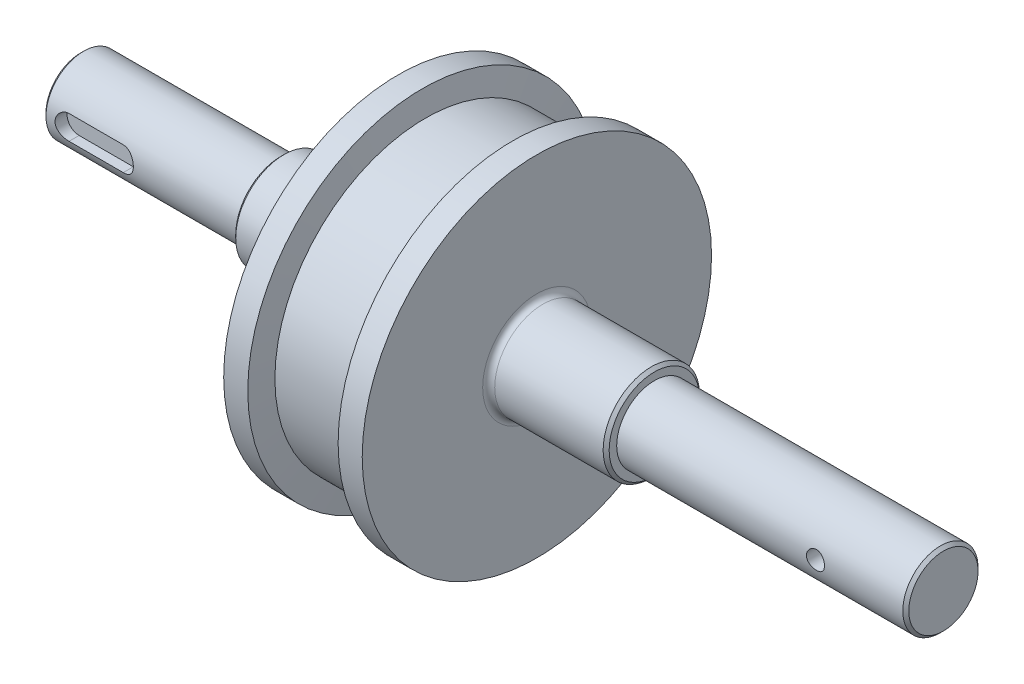
ISO-10303-21;
HEADER;
FILE_DESCRIPTION(('STEP AP214'),'2;1');
FILE_NAME('part.step','',(''),(''),'','','');
FILE_SCHEMA(('AUTOMOTIVE_DESIGN { 1 0 10303 214 1 1 1 1 }'));
ENDSEC;
DATA;
#1=APPLICATION_CONTEXT('core data for automotive mechanical design processes');
#2=APPLICATION_PROTOCOL_DEFINITION('international standard','automotive_design',2000,#1);
#3=PRODUCT_CONTEXT('',#1,'mechanical');
#4=PRODUCT('Part','Part','',(#3));
#5=PRODUCT_RELATED_PRODUCT_CATEGORY('part','',(#4));
#6=PRODUCT_DEFINITION_FORMATION('','',#4);
#7=PRODUCT_DEFINITION_CONTEXT('part definition',#1,'design');
#8=PRODUCT_DEFINITION('design','',#6,#7);
#9=PRODUCT_DEFINITION_SHAPE('','',#8);
#10=(LENGTH_UNIT() NAMED_UNIT(*) SI_UNIT(.MILLI.,.METRE.));
#11=(NAMED_UNIT(*) PLANE_ANGLE_UNIT() SI_UNIT($,.RADIAN.));
#12=(NAMED_UNIT(*) SI_UNIT($,.STERADIAN.) SOLID_ANGLE_UNIT());
#13=UNCERTAINTY_MEASURE_WITH_UNIT(LENGTH_MEASURE(1.E-05),#10,'distance_accuracy_value','');
#14=(GEOMETRIC_REPRESENTATION_CONTEXT(3) GLOBAL_UNCERTAINTY_ASSIGNED_CONTEXT((#13)) GLOBAL_UNIT_ASSIGNED_CONTEXT((#10,
#11,#12)) REPRESENTATION_CONTEXT('',''));
#15=CARTESIAN_POINT('',(0.,0.,0.));
#16=DIRECTION('',(0.,0.,1.));
#17=DIRECTION('',(1.,0.,0.));
#18=AXIS2_PLACEMENT_3D('',#15,#16,#17);
#19=CARTESIAN_POINT('',(286.5,0.,0.));
#20=DIRECTION('',(-1.,0.,0.));
#21=DIRECTION('',(0.,0.,1.));
#22=AXIS2_PLACEMENT_3D('',#19,#20,#21);
#23=PLANE('',#22);
#24=CARTESIAN_POINT('',(286.5,0.,0.));
#25=DIRECTION('',(-1.,0.,0.));
#26=DIRECTION('',(0.,0.,1.));
#27=AXIS2_PLACEMENT_3D('',#24,#25,#26);
#28=CIRCLE('',#27,11.5);
#29=CARTESIAN_POINT('',(286.5,0.,11.5));
#30=VERTEX_POINT('',#29);
#31=EDGE_CURVE('E161',#30,#30,#28,.T.);
#32=ORIENTED_EDGE('',*,*,#31,.F.);
#33=EDGE_LOOP('',(#32));
#34=FACE_BOUND('',#33,.T.);
#35=ADVANCED_FACE('F34',(#34),#23,.F.);
#36=CARTESIAN_POINT('',(286.5,0.,0.));
#37=DIRECTION('',(-1.,0.,0.));
#38=DIRECTION('',(0.,0.,1.));
#39=AXIS2_PLACEMENT_3D('',#36,#37,#38);
#40=CONICAL_SURFACE('',#39,11.5,0.785398163397448);
#41=CARTESIAN_POINT('',(285.5,0.,0.));
#42=DIRECTION('',(-1.,0.,0.));
#43=DIRECTION('',(0.,0.,1.));
#44=AXIS2_PLACEMENT_3D('',#41,#42,#43);
#45=CIRCLE('',#44,12.5);
#46=CARTESIAN_POINT('',(285.5,0.,12.5));
#47=VERTEX_POINT('',#46);
#48=EDGE_CURVE('E158',#47,#47,#45,.T.);
#49=ORIENTED_EDGE('',*,*,#48,.F.);
#50=EDGE_LOOP('',(#49));
#51=FACE_BOUND('',#50,.T.);
#52=ORIENTED_EDGE('',*,*,#31,.T.);
#53=EDGE_LOOP('',(#52));
#54=FACE_BOUND('',#53,.T.);
#55=ADVANCED_FACE('F227',(#51,#54),#40,.T.);
#56=CARTESIAN_POINT('',(0.,0.,0.));
#57=DIRECTION('',(-1.,0.,0.));
#58=DIRECTION('',(0.,0.,1.));
#59=AXIS2_PLACEMENT_3D('',#56,#57,#58);
#60=CYLINDRICAL_SURFACE('',#59,12.5);
#61=CARTESIAN_POINT('',(259.5,0.,12.5));
#62=CARTESIAN_POINT('',(259.499994975923,-0.165963929028717,12.4999970714968));
#63=CARTESIAN_POINT('',(259.486181589764,-0.33198542092807,12.4966615634859));
#64=CARTESIAN_POINT('',(259.431367260405,-0.659284290971382,12.4836783946933));
#65=CARTESIAN_POINT('',(259.390349572005,-0.820558683214273,12.4740268462166));
#66=CARTESIAN_POINT('',(259.282507665496,-1.13358839471401,12.4494823208195));
#67=CARTESIAN_POINT('',(259.215713110142,-1.28535442324821,12.4345953702841));
#68=CARTESIAN_POINT('',(259.058314563554,-1.57552517879761,12.4011725442513));
#69=CARTESIAN_POINT('',(258.967710231923,-1.71392971475165,12.3826366165873));
#70=CARTESIAN_POINT('',(258.763435821624,-1.97609263393971,12.3435386014785));
#71=CARTESIAN_POINT('',(258.649397218951,-2.09955952100478,12.3229472454311));
#72=CARTESIAN_POINT('',(258.402281130935,-2.3258108081194,12.2822574370147));
#73=CARTESIAN_POINT('',(258.269201657959,-2.42859304624486,12.2621590363612));
#74=CARTESIAN_POINT('',(257.985554166982,-2.61189993555013,12.224437969062));
#75=CARTESIAN_POINT('',(257.834773416241,-2.69210377047564,12.2068525815312));
#76=CARTESIAN_POINT('',(257.521380164871,-2.82591582947333,12.1765733412448));
#77=CARTESIAN_POINT('',(257.358769397977,-2.87952794169564,12.1638787734309));
#78=CARTESIAN_POINT('',(257.029523426731,-2.95765058108663,12.1451184675007));
#79=CARTESIAN_POINT('',(256.863018878474,-2.98268262400616,12.1389341034343));
#80=CARTESIAN_POINT('',(256.528067620357,-3.00455808879086,12.1335389605945));
#81=CARTESIAN_POINT('',(256.359621204043,-3.00140571682399,12.1343271412568));
#82=CARTESIAN_POINT('',(256.029524033987,-2.96741912081941,12.1426811387008));
#83=CARTESIAN_POINT('',(255.86780543481,-2.93720103400493,12.1500960921292));
#84=CARTESIAN_POINT('',(255.551802683352,-2.85092141637188,12.1706283738785));
#85=CARTESIAN_POINT('',(255.397519024266,-2.79485817372026,12.1837460799133));
#86=CARTESIAN_POINT('',(255.099087021916,-2.6579412123178,12.2143476734445));
#87=CARTESIAN_POINT('',(254.955047547083,-2.57685948246955,12.2318714325758));
#88=CARTESIAN_POINT('',(254.682395499277,-2.39236688956377,12.2692875046197));
#89=CARTESIAN_POINT('',(254.553785434715,-2.28895240342643,12.2891802016137));
#90=CARTESIAN_POINT('',(254.312106429681,-2.05951493908845,12.329732025739));
#91=CARTESIAN_POINT('',(254.199532900938,-1.93297064389907,12.3503975788014));
#92=CARTESIAN_POINT('',(253.997115280254,-1.66255592459692,12.3896951594929));
#93=CARTESIAN_POINT('',(253.907271779707,-1.51868504982142,12.4083271342049));
#94=CARTESIAN_POINT('',(253.752702779387,-1.21702847718583,12.4415394956922));
#95=CARTESIAN_POINT('',(253.688052543762,-1.05920278696055,12.4561077058019));
#96=CARTESIAN_POINT('',(253.586334920951,-0.734497606078682,12.4794620474154));
#97=CARTESIAN_POINT('',(253.549262682373,-0.567619713387675,12.4882491958651));
#98=CARTESIAN_POINT('',(253.504497935348,-0.233787399651684,12.4989027542709));
#99=CARTESIAN_POINT('',(253.496130107538,-0.0669284805450252,12.5009282130753));
#100=CARTESIAN_POINT('',(253.507166766851,0.265804381586615,12.4982807419474));
#101=CARTESIAN_POINT('',(253.526568961987,0.43167840476494,12.4936083648176));
#102=CARTESIAN_POINT('',(253.592036978516,0.755422580108832,12.4781916395217));
#103=CARTESIAN_POINT('',(253.637739109574,0.913370579311284,12.4675301590363));
#104=CARTESIAN_POINT('',(253.754098191695,1.21935330013475,12.4413335015664));
#105=CARTESIAN_POINT('',(253.824757542978,1.3673870666415,12.4257978558334));
#106=CARTESIAN_POINT('',(253.990366593598,1.65206150995569,12.3911910149582));
#107=CARTESIAN_POINT('',(254.085700716924,1.78847176740352,12.3720653178033));
#108=CARTESIAN_POINT('',(254.297456929013,2.04359904096629,12.3324936406987));
#109=CARTESIAN_POINT('',(254.413882356081,2.16231325074335,12.3120474520734));
#110=CARTESIAN_POINT('',(254.667640831208,2.38142453789941,12.2715742142771));
#111=CARTESIAN_POINT('',(254.805385122082,2.48134974047368,12.2515669262669));
#112=CARTESIAN_POINT('',(255.096090427897,2.65666020824079,12.2147538797452));
#113=CARTESIAN_POINT('',(255.249050761093,2.73204657223349,12.1979479778962));
#114=CARTESIAN_POINT('',(255.565012513544,2.8555899351817,12.1696189519335));
#115=CARTESIAN_POINT('',(255.727948203421,2.90390754385903,12.1580647463107));
#116=CARTESIAN_POINT('',(256.059946185021,2.97238380283977,12.1415072663683));
#117=CARTESIAN_POINT('',(256.229007253762,2.9925480427499,12.1365026916888));
#118=CARTESIAN_POINT('',(256.563670700281,3.00387066449353,12.1337046220624));
#119=CARTESIAN_POINT('',(256.729246496327,2.99578106592265,12.1357241633848));
#120=CARTESIAN_POINT('',(257.056599764224,2.95253345626267,12.1463176460425));
#121=CARTESIAN_POINT('',(257.218377301111,2.91737590900097,12.1548914750658));
#122=CARTESIAN_POINT('',(257.532797552548,2.82138591303537,12.1775274976748));
#123=CARTESIAN_POINT('',(257.685482272584,2.76068402045612,12.191561756094));
#124=CARTESIAN_POINT('',(257.978604413884,2.61543373580582,12.2235433612686));
#125=CARTESIAN_POINT('',(258.119040268586,2.53088229934854,12.2414912075257));
#126=CARTESIAN_POINT('',(258.387337000119,2.33793007708462,12.2798193255291));
#127=CARTESIAN_POINT('',(258.514812323099,2.22900267979017,12.3002478697533));
#128=CARTESIAN_POINT('',(258.749919988052,1.99143074773235,12.3409359831145));
#129=CARTESIAN_POINT('',(258.85754766321,1.86278158874234,12.361195511444));
#130=CARTESIAN_POINT('',(259.051609259555,1.5868829988014,12.3996570299581));
#131=CARTESIAN_POINT('',(259.137668405442,1.43936414359402,12.4178200201219));
#132=CARTESIAN_POINT('',(259.283629532748,1.13153622828568,12.4496380610582));
#133=CARTESIAN_POINT('',(259.343551343392,0.971236973691231,12.4632965272855));
#134=CARTESIAN_POINT('',(259.426038625138,0.675887025694777,12.4824059901497));
#135=CARTESIAN_POINT('',(259.453716615786,0.542312066268429,12.4889599449579));
#136=CARTESIAN_POINT('',(259.490698780852,0.272504227478251,12.4977580149525));
#137=CARTESIAN_POINT('',(259.500004125225,0.136271517915779,12.5000024045682));
#138=CARTESIAN_POINT('',(259.5,0.,12.5));
#139=B_SPLINE_CURVE_WITH_KNOTS('',3,(#61,#62,#63,#64,#65,#66,#67,#68,#69,#70,#71,#72,#73,#74,
#75,#76,#77,#78,#79,#80,#81,#82,#83,#84,#85,#86,#87,#88,#89,#90,#91,#92,#93,#94,#95,#96,#97,#98,
#99,#100,#101,#102,#103,#104,#105,#106,#107,#108,#109,#110,#111,#112,#113,#114,#115,#116,#117,
#118,#119,#120,#121,#122,#123,#124,#125,#126,#127,#128,#129,#130,#131,#132,#133,#134,#135,#136,
#137,#138),.UNSPECIFIED.,.T.,.F.,(4,2,2,2,2,2,2,2,2,2,2,2,2,2,2,2,2,2,2,2,2,2,2,2,2,2,2,2,2,2,2,
2,2,2,2,2,2,2,4),(0.,0.497392599366681,0.995091645758821,1.492219664085,1.98935478998519,
2.49500570148353,3.00070943533304,3.51327262050847,4.02576083835035,4.52873995359107,
5.03164400680462,5.5233827496484,6.01515406709141,6.51154667521178,7.00801987450008,
7.51749958381934,8.02699254752168,8.53799614678202,9.04890983140412,9.54771776810823,
10.0464845383097,10.5385143736981,11.0305915421211,11.5308523313794,12.031192370573,
12.5427824523192,13.0543496229377,13.5628484119092,14.0712462285018,14.5662165454701,
15.0611783809799,15.5536406351283,16.0461657803878,16.5505844610431,17.0551215958269,
17.5678974206351,18.0802835459068,18.4887142303991,18.897118905514),.UNSPECIFIED.);
#140=CARTESIAN_POINT('',(259.5,0.,12.5));
#141=VERTEX_POINT('',#140);
#142=EDGE_CURVE('E107',#141,#141,#139,.T.);
#143=ORIENTED_EDGE('',*,*,#142,.T.);
#144=EDGE_LOOP('',(#143));
#145=FACE_BOUND('',#144,.T.);
#146=CARTESIAN_POINT('',(259.5,0.,-12.5));
#147=CARTESIAN_POINT('',(259.499994975923,0.165963929028717,-12.4999970714968));
#148=CARTESIAN_POINT('',(259.486181589764,0.33198542092807,-12.4966615634859));
#149=CARTESIAN_POINT('',(259.431367260405,0.659284290971382,-12.4836783946933));
#150=CARTESIAN_POINT('',(259.390349572005,0.820558683214273,-12.4740268462166));
#151=CARTESIAN_POINT('',(259.282507665496,1.13358839471401,-12.4494823208195));
#152=CARTESIAN_POINT('',(259.215713110142,1.28535442324821,-12.4345953702841));
#153=CARTESIAN_POINT('',(259.058314563554,1.57552517879761,-12.4011725442513));
#154=CARTESIAN_POINT('',(258.967710231923,1.71392971475165,-12.3826366165873));
#155=CARTESIAN_POINT('',(258.763435821624,1.97609263393971,-12.3435386014785));
#156=CARTESIAN_POINT('',(258.649397218951,2.09955952100478,-12.3229472454311));
#157=CARTESIAN_POINT('',(258.402281130935,2.3258108081194,-12.2822574370147));
#158=CARTESIAN_POINT('',(258.269201657959,2.42859304624486,-12.2621590363612));
#159=CARTESIAN_POINT('',(257.985554166982,2.61189993555013,-12.224437969062));
#160=CARTESIAN_POINT('',(257.834773416241,2.69210377047564,-12.2068525815312));
#161=CARTESIAN_POINT('',(257.521380164871,2.82591582947333,-12.1765733412448));
#162=CARTESIAN_POINT('',(257.358769397977,2.87952794169564,-12.1638787734309));
#163=CARTESIAN_POINT('',(257.029523426731,2.95765058108663,-12.1451184675007));
#164=CARTESIAN_POINT('',(256.863018878474,2.98268262400616,-12.1389341034343));
#165=CARTESIAN_POINT('',(256.528067620357,3.00455808879086,-12.1335389605945));
#166=CARTESIAN_POINT('',(256.359621204043,3.00140571682399,-12.1343271412568));
#167=CARTESIAN_POINT('',(256.029524033987,2.96741912081941,-12.1426811387008));
#168=CARTESIAN_POINT('',(255.86780543481,2.93720103400493,-12.1500960921292));
#169=CARTESIAN_POINT('',(255.551802683352,2.85092141637188,-12.1706283738785));
#170=CARTESIAN_POINT('',(255.397519024266,2.79485817372026,-12.1837460799133));
#171=CARTESIAN_POINT('',(255.099087021916,2.6579412123178,-12.2143476734445));
#172=CARTESIAN_POINT('',(254.955047547083,2.57685948246955,-12.2318714325758));
#173=CARTESIAN_POINT('',(254.682395499277,2.39236688956377,-12.2692875046197));
#174=CARTESIAN_POINT('',(254.553785434715,2.28895240342643,-12.2891802016137));
#175=CARTESIAN_POINT('',(254.312106429681,2.05951493908845,-12.329732025739));
#176=CARTESIAN_POINT('',(254.199532900938,1.93297064389907,-12.3503975788014));
#177=CARTESIAN_POINT('',(253.997115280254,1.66255592459692,-12.3896951594929));
#178=CARTESIAN_POINT('',(253.907271779707,1.51868504982142,-12.4083271342049));
#179=CARTESIAN_POINT('',(253.752702779387,1.21702847718583,-12.4415394956922));
#180=CARTESIAN_POINT('',(253.688052543762,1.05920278696055,-12.4561077058019));
#181=CARTESIAN_POINT('',(253.586334920951,0.734497606078682,-12.4794620474154));
#182=CARTESIAN_POINT('',(253.549262682373,0.567619713387675,-12.4882491958651));
#183=CARTESIAN_POINT('',(253.504497935348,0.233787399651684,-12.4989027542709));
#184=CARTESIAN_POINT('',(253.496130107538,0.0669284805450252,-12.5009282130753));
#185=CARTESIAN_POINT('',(253.507166766851,-0.265804381586615,-12.4982807419474));
#186=CARTESIAN_POINT('',(253.526568961987,-0.43167840476494,-12.4936083648176));
#187=CARTESIAN_POINT('',(253.592036978516,-0.755422580108832,-12.4781916395217));
#188=CARTESIAN_POINT('',(253.637739109574,-0.913370579311284,-12.4675301590363));
#189=CARTESIAN_POINT('',(253.754098191695,-1.21935330013475,-12.4413335015664));
#190=CARTESIAN_POINT('',(253.824757542978,-1.3673870666415,-12.4257978558334));
#191=CARTESIAN_POINT('',(253.990366593598,-1.65206150995569,-12.3911910149582));
#192=CARTESIAN_POINT('',(254.085700716924,-1.78847176740352,-12.3720653178033));
#193=CARTESIAN_POINT('',(254.297456929013,-2.04359904096629,-12.3324936406987));
#194=CARTESIAN_POINT('',(254.413882356081,-2.16231325074335,-12.3120474520734));
#195=CARTESIAN_POINT('',(254.667640831208,-2.38142453789941,-12.2715742142771));
#196=CARTESIAN_POINT('',(254.805385122082,-2.48134974047368,-12.2515669262669));
#197=CARTESIAN_POINT('',(255.096090427897,-2.65666020824079,-12.2147538797452));
#198=CARTESIAN_POINT('',(255.249050761093,-2.73204657223349,-12.1979479778962));
#199=CARTESIAN_POINT('',(255.565012513544,-2.8555899351817,-12.1696189519335));
#200=CARTESIAN_POINT('',(255.727948203421,-2.90390754385903,-12.1580647463107));
#201=CARTESIAN_POINT('',(256.059946185021,-2.97238380283977,-12.1415072663683));
#202=CARTESIAN_POINT('',(256.229007253762,-2.9925480427499,-12.1365026916888));
#203=CARTESIAN_POINT('',(256.563670700281,-3.00387066449353,-12.1337046220624));
#204=CARTESIAN_POINT('',(256.729246496327,-2.99578106592265,-12.1357241633848));
#205=CARTESIAN_POINT('',(257.056599764224,-2.95253345626267,-12.1463176460425));
#206=CARTESIAN_POINT('',(257.218377301111,-2.91737590900097,-12.1548914750658));
#207=CARTESIAN_POINT('',(257.532797552548,-2.82138591303537,-12.1775274976748));
#208=CARTESIAN_POINT('',(257.685482272584,-2.76068402045612,-12.191561756094));
#209=CARTESIAN_POINT('',(257.978604413884,-2.61543373580582,-12.2235433612686));
#210=CARTESIAN_POINT('',(258.119040268586,-2.53088229934854,-12.2414912075257));
#211=CARTESIAN_POINT('',(258.387337000119,-2.33793007708462,-12.2798193255291));
#212=CARTESIAN_POINT('',(258.514812323099,-2.22900267979017,-12.3002478697533));
#213=CARTESIAN_POINT('',(258.749919988052,-1.99143074773235,-12.3409359831145));
#214=CARTESIAN_POINT('',(258.85754766321,-1.86278158874234,-12.361195511444));
#215=CARTESIAN_POINT('',(259.051609259555,-1.5868829988014,-12.3996570299581));
#216=CARTESIAN_POINT('',(259.137668405442,-1.43936414359402,-12.4178200201219));
#217=CARTESIAN_POINT('',(259.283629532748,-1.13153622828568,-12.4496380610582));
#218=CARTESIAN_POINT('',(259.343551343392,-0.971236973691231,-12.4632965272855));
#219=CARTESIAN_POINT('',(259.426038625138,-0.675887025694777,-12.4824059901497));
#220=CARTESIAN_POINT('',(259.453716615786,-0.542312066268429,-12.4889599449579));
#221=CARTESIAN_POINT('',(259.490698780852,-0.272504227478251,-12.4977580149525));
#222=CARTESIAN_POINT('',(259.500004125225,-0.136271517915779,-12.5000024045682));
#223=CARTESIAN_POINT('',(259.5,0.,-12.5));
#224=B_SPLINE_CURVE_WITH_KNOTS('',3,(#146,#147,#148,#149,#150,#151,#152,#153,#154,#155,#156,
#157,#158,#159,#160,#161,#162,#163,#164,#165,#166,#167,#168,#169,#170,#171,#172,#173,#174,#175,
#176,#177,#178,#179,#180,#181,#182,#183,#184,#185,#186,#187,#188,#189,#190,#191,#192,#193,#194,
#195,#196,#197,#198,#199,#200,#201,#202,#203,#204,#205,#206,#207,#208,#209,#210,#211,#212,#213,
#214,#215,#216,#217,#218,#219,#220,#221,#222,#223),.UNSPECIFIED.,.T.,.F.,(4,2,2,2,2,2,2,2,2,2,2,
2,2,2,2,2,2,2,2,2,2,2,2,2,2,2,2,2,2,2,2,2,2,2,2,2,2,2,4),(0.,0.497392599366681,
0.995091645758821,1.492219664085,1.98935478998519,2.49500570148353,3.00070943533304,
3.51327262050847,4.02576083835035,4.52873995359107,5.03164400680462,5.5233827496484,
6.01515406709141,6.51154667521178,7.00801987450008,7.51749958381934,8.02699254752168,
8.53799614678202,9.04890983140412,9.54771776810823,10.0464845383097,10.5385143736981,
11.0305915421211,11.5308523313794,12.031192370573,12.5427824523192,13.0543496229377,
13.5628484119092,14.0712462285018,14.5662165454701,15.0611783809799,15.5536406351283,
16.0461657803878,16.5505844610431,17.0551215958269,17.5678974206351,18.0802835459068,
18.4887142303991,18.897118905514),.UNSPECIFIED.);
#225=CARTESIAN_POINT('',(259.5,0.,-12.5));
#226=VERTEX_POINT('',#225);
#227=EDGE_CURVE('E99',#226,#226,#224,.T.);
#228=ORIENTED_EDGE('',*,*,#227,.T.);
#229=EDGE_LOOP('',(#228));
#230=FACE_BOUND('',#229,.T.);
#231=CARTESIAN_POINT('',(190.5,0.,0.));
#232=DIRECTION('',(-1.,0.,0.));
#233=DIRECTION('',(0.,0.,1.));
#234=AXIS2_PLACEMENT_3D('',#231,#232,#233);
#235=CIRCLE('',#234,12.5);
#236=CARTESIAN_POINT('',(190.5,0.,12.5));
#237=VERTEX_POINT('',#236);
#238=EDGE_CURVE('E155',#237,#237,#235,.T.);
#239=ORIENTED_EDGE('',*,*,#238,.F.);
#240=EDGE_LOOP('',(#239));
#241=FACE_BOUND('',#240,.T.);
#242=ORIENTED_EDGE('',*,*,#48,.T.);
#243=EDGE_LOOP('',(#242));
#244=FACE_BOUND('',#243,.T.);
#245=ADVANCED_FACE('F176',(#145,#230,#241,#244),#60,.T.);
#246=CARTESIAN_POINT('',(190.5,15.,0.));
#247=DIRECTION('',(-1.,0.,0.));
#248=DIRECTION('',(0.,0.,1.));
#249=AXIS2_PLACEMENT_3D('',#246,#247,#248);
#250=PLANE('',#249);
#251=CARTESIAN_POINT('',(190.5,0.,0.));
#252=DIRECTION('',(-1.,0.,0.));
#253=DIRECTION('',(0.,0.,1.));
#254=AXIS2_PLACEMENT_3D('',#251,#252,#253);
#255=CIRCLE('',#254,15.);
#256=CARTESIAN_POINT('',(190.5,0.,15.));
#257=VERTEX_POINT('',#256);
#258=EDGE_CURVE('E152',#257,#257,#255,.T.);
#259=ORIENTED_EDGE('',*,*,#258,.F.);
#260=EDGE_LOOP('',(#259));
#261=FACE_BOUND('',#260,.T.);
#262=ORIENTED_EDGE('',*,*,#238,.T.);
#263=EDGE_LOOP('',(#262));
#264=FACE_BOUND('',#263,.T.);
#265=ADVANCED_FACE('F238',(#261,#264),#250,.F.);
#266=CARTESIAN_POINT('',(190.5,0.,0.));
#267=DIRECTION('',(-1.,0.,0.));
#268=DIRECTION('',(0.,0.,1.));
#269=AXIS2_PLACEMENT_3D('',#266,#267,#268);
#270=CONICAL_SURFACE('',#269,15.,0.785398163397447);
#271=CARTESIAN_POINT('',(189.5,0.,0.));
#272=DIRECTION('',(-1.,0.,0.));
#273=DIRECTION('',(0.,0.,1.));
#274=AXIS2_PLACEMENT_3D('',#271,#272,#273);
#275=CIRCLE('',#274,16.);
#276=CARTESIAN_POINT('',(189.5,0.,16.));
#277=VERTEX_POINT('',#276);
#278=EDGE_CURVE('E149',#277,#277,#275,.T.);
#279=ORIENTED_EDGE('',*,*,#278,.F.);
#280=EDGE_LOOP('',(#279));
#281=FACE_BOUND('',#280,.T.);
#282=ORIENTED_EDGE('',*,*,#258,.T.);
#283=EDGE_LOOP('',(#282));
#284=FACE_BOUND('',#283,.T.);
#285=ADVANCED_FACE('F245',(#281,#284),#270,.T.);
#286=CARTESIAN_POINT('',(0.,0.,0.));
#287=DIRECTION('',(-1.,0.,0.));
#288=DIRECTION('',(0.,0.,1.));
#289=AXIS2_PLACEMENT_3D('',#286,#287,#288);
#290=CYLINDRICAL_SURFACE('',#289,16.);
#291=CARTESIAN_POINT('',(153.5,0.,0.));
#292=DIRECTION('',(-1.,0.,0.));
#293=DIRECTION('',(0.,0.,1.));
#294=AXIS2_PLACEMENT_3D('',#291,#292,#293);
#295=CIRCLE('',#294,16.);
#296=CARTESIAN_POINT('',(153.5,0.,16.));
#297=VERTEX_POINT('',#296);
#298=EDGE_CURVE('E146',#297,#297,#295,.T.);
#299=ORIENTED_EDGE('',*,*,#298,.F.);
#300=EDGE_LOOP('',(#299));
#301=FACE_BOUND('',#300,.T.);
#302=ORIENTED_EDGE('',*,*,#278,.T.);
#303=EDGE_LOOP('',(#302));
#304=FACE_BOUND('',#303,.T.);
#305=ADVANCED_FACE('F258',(#301,#304),#290,.T.);
#306=CARTESIAN_POINT('',(153.5,0.,0.));
#307=DIRECTION('',(-1.,0.,0.));
#308=DIRECTION('',(0.,0.,1.));
#309=AXIS2_PLACEMENT_3D('',#306,#307,#308);
#310=TOROIDAL_SURFACE('',#309,18.,2.);
#311=CARTESIAN_POINT('',(151.5,0.,0.));
#312=DIRECTION('',(-1.,0.,0.));
#313=DIRECTION('',(0.,0.,1.));
#314=AXIS2_PLACEMENT_3D('',#311,#312,#313);
#315=CIRCLE('',#314,18.);
#316=CARTESIAN_POINT('',(151.5,0.,18.));
#317=VERTEX_POINT('',#316);
#318=EDGE_CURVE('E143',#317,#317,#315,.T.);
#319=ORIENTED_EDGE('',*,*,#318,.F.);
#320=EDGE_LOOP('',(#319));
#321=FACE_BOUND('',#320,.T.);
#322=ORIENTED_EDGE('',*,*,#298,.T.);
#323=EDGE_LOOP('',(#322));
#324=FACE_BOUND('',#323,.T.);
#325=ADVANCED_FACE('F265',(#321,#324),#310,.F.);
#326=CARTESIAN_POINT('',(151.5,58.,0.));
#327=DIRECTION('',(-1.,0.,0.));
#328=DIRECTION('',(0.,0.,1.));
#329=AXIS2_PLACEMENT_3D('',#326,#327,#328);
#330=PLANE('',#329);
#331=CARTESIAN_POINT('',(151.5,0.,0.));
#332=DIRECTION('',(-1.,0.,0.));
#333=DIRECTION('',(0.,0.,1.));
#334=AXIS2_PLACEMENT_3D('',#331,#332,#333);
#335=CIRCLE('',#334,58.);
#336=CARTESIAN_POINT('',(151.5,0.,58.));
#337=VERTEX_POINT('',#336);
#338=EDGE_CURVE('E140',#337,#337,#335,.T.);
#339=ORIENTED_EDGE('',*,*,#338,.F.);
#340=EDGE_LOOP('',(#339));
#341=FACE_BOUND('',#340,.T.);
#342=ORIENTED_EDGE('',*,*,#318,.T.);
#343=EDGE_LOOP('',(#342));
#344=FACE_BOUND('',#343,.T.);
#345=ADVANCED_FACE('F269',(#341,#344),#330,.F.);
#346=CARTESIAN_POINT('',(0.,0.,0.));
#347=DIRECTION('',(-1.,0.,0.));
#348=DIRECTION('',(0.,0.,1.));
#349=AXIS2_PLACEMENT_3D('',#346,#347,#348);
#350=CYLINDRICAL_SURFACE('',#349,58.);
#351=CARTESIAN_POINT('',(143.5,0.,0.));
#352=DIRECTION('',(-1.,0.,0.));
#353=DIRECTION('',(0.,0.,1.));
#354=AXIS2_PLACEMENT_3D('',#351,#352,#353);
#355=CIRCLE('',#354,58.);
#356=CARTESIAN_POINT('',(143.5,0.,58.));
#357=VERTEX_POINT('',#356);
#358=EDGE_CURVE('E137',#357,#357,#355,.T.);
#359=ORIENTED_EDGE('',*,*,#358,.F.);
#360=EDGE_LOOP('',(#359));
#361=FACE_BOUND('',#360,.T.);
#362=ORIENTED_EDGE('',*,*,#338,.T.);
#363=EDGE_LOOP('',(#362));
#364=FACE_BOUND('',#363,.T.);
#365=ADVANCED_FACE('F273',(#361,#364),#350,.T.);
#366=CARTESIAN_POINT('',(143.5,0.,0.));
#367=DIRECTION('',(1.,0.,0.));
#368=DIRECTION('',(0.,0.,-1.));
#369=AXIS2_PLACEMENT_3D('',#366,#367,#368);
#370=CONICAL_SURFACE('',#369,58.,1.44644133224814);
#371=CARTESIAN_POINT('',(142.5,0.,0.));
#372=DIRECTION('',(-1.,0.,0.));
#373=DIRECTION('',(0.,0.,1.));
#374=AXIS2_PLACEMENT_3D('',#371,#372,#373);
#375=CIRCLE('',#374,50.);
#376=CARTESIAN_POINT('',(142.5,0.,50.));
#377=VERTEX_POINT('',#376);
#378=EDGE_CURVE('E134',#377,#377,#375,.T.);
#379=ORIENTED_EDGE('',*,*,#378,.F.);
#380=EDGE_LOOP('',(#379));
#381=FACE_BOUND('',#380,.T.);
#382=ORIENTED_EDGE('',*,*,#358,.T.);
#383=EDGE_LOOP('',(#382));
#384=FACE_BOUND('',#383,.T.);
#385=ADVANCED_FACE('F277',(#381,#384),#370,.T.);
#386=CARTESIAN_POINT('',(0.,0.,0.));
#387=DIRECTION('',(-1.,0.,0.));
#388=DIRECTION('',(0.,0.,1.));
#389=AXIS2_PLACEMENT_3D('',#386,#387,#388);
#390=CYLINDRICAL_SURFACE('',#389,50.);
#391=CARTESIAN_POINT('',(114.5,0.,0.));
#392=DIRECTION('',(-1.,0.,0.));
#393=DIRECTION('',(0.,0.,1.));
#394=AXIS2_PLACEMENT_3D('',#391,#392,#393);
#395=CIRCLE('',#394,50.);
#396=CARTESIAN_POINT('',(114.5,0.,50.));
#397=VERTEX_POINT('',#396);
#398=EDGE_CURVE('E131',#397,#397,#395,.T.);
#399=ORIENTED_EDGE('',*,*,#398,.F.);
#400=EDGE_LOOP('',(#399));
#401=FACE_BOUND('',#400,.T.);
#402=ORIENTED_EDGE('',*,*,#378,.T.);
#403=EDGE_LOOP('',(#402));
#404=FACE_BOUND('',#403,.T.);
#405=ADVANCED_FACE('F281',(#401,#404),#390,.T.);
#406=CARTESIAN_POINT('',(114.5,0.,0.));
#407=DIRECTION('',(-1.,0.,0.));
#408=DIRECTION('',(0.,0.,1.));
#409=AXIS2_PLACEMENT_3D('',#406,#407,#408);
#410=CONICAL_SURFACE('',#409,50.,1.44644133224814);
#411=CARTESIAN_POINT('',(113.5,0.,0.));
#412=DIRECTION('',(-1.,0.,0.));
#413=DIRECTION('',(0.,0.,1.));
#414=AXIS2_PLACEMENT_3D('',#411,#412,#413);
#415=CIRCLE('',#414,58.);
#416=CARTESIAN_POINT('',(113.5,0.,58.));
#417=VERTEX_POINT('',#416);
#418=EDGE_CURVE('E128',#417,#417,#415,.T.);
#419=ORIENTED_EDGE('',*,*,#418,.F.);
#420=EDGE_LOOP('',(#419));
#421=FACE_BOUND('',#420,.T.);
#422=ORIENTED_EDGE('',*,*,#398,.T.);
#423=EDGE_LOOP('',(#422));
#424=FACE_BOUND('',#423,.T.);
#425=ADVANCED_FACE('F285',(#421,#424),#410,.T.);
#426=CARTESIAN_POINT('',(0.,0.,0.));
#427=DIRECTION('',(-1.,0.,0.));
#428=DIRECTION('',(0.,0.,1.));
#429=AXIS2_PLACEMENT_3D('',#426,#427,#428);
#430=CYLINDRICAL_SURFACE('',#429,58.);
#431=CARTESIAN_POINT('',(105.5,0.,0.));
#432=DIRECTION('',(-1.,0.,0.));
#433=DIRECTION('',(0.,0.,1.));
#434=AXIS2_PLACEMENT_3D('',#431,#432,#433);
#435=CIRCLE('',#434,58.);
#436=CARTESIAN_POINT('',(105.5,0.,58.));
#437=VERTEX_POINT('',#436);
#438=EDGE_CURVE('E125',#437,#437,#435,.T.);
#439=ORIENTED_EDGE('',*,*,#438,.F.);
#440=EDGE_LOOP('',(#439));
#441=FACE_BOUND('',#440,.T.);
#442=ORIENTED_EDGE('',*,*,#418,.T.);
#443=EDGE_LOOP('',(#442));
#444=FACE_BOUND('',#443,.T.);
#445=ADVANCED_FACE('F289',(#441,#444),#430,.T.);
#446=CARTESIAN_POINT('',(105.5,18.,0.));
#447=DIRECTION('',(1.,0.,0.));
#448=DIRECTION('',(0.,0.,-1.));
#449=AXIS2_PLACEMENT_3D('',#446,#447,#448);
#450=PLANE('',#449);
#451=CARTESIAN_POINT('',(105.5,0.,0.));
#452=DIRECTION('',(-1.,0.,0.));
#453=DIRECTION('',(0.,0.,1.));
#454=AXIS2_PLACEMENT_3D('',#451,#452,#453);
#455=CIRCLE('',#454,18.);
#456=CARTESIAN_POINT('',(105.5,0.,18.));
#457=VERTEX_POINT('',#456);
#458=EDGE_CURVE('E122',#457,#457,#455,.T.);
#459=ORIENTED_EDGE('',*,*,#458,.F.);
#460=EDGE_LOOP('',(#459));
#461=FACE_BOUND('',#460,.T.);
#462=ORIENTED_EDGE('',*,*,#438,.T.);
#463=EDGE_LOOP('',(#462));
#464=FACE_BOUND('',#463,.T.);
#465=ADVANCED_FACE('F293',(#461,#464),#450,.F.);
#466=CARTESIAN_POINT('',(103.5,0.,0.));
#467=DIRECTION('',(-1.,0.,0.));
#468=DIRECTION('',(0.,0.,1.));
#469=AXIS2_PLACEMENT_3D('',#466,#467,#468);
#470=TOROIDAL_SURFACE('',#469,18.,2.);
#471=CARTESIAN_POINT('',(103.5,0.,0.));
#472=DIRECTION('',(-1.,0.,0.));
#473=DIRECTION('',(0.,0.,1.));
#474=AXIS2_PLACEMENT_3D('',#471,#472,#473);
#475=CIRCLE('',#474,16.);
#476=CARTESIAN_POINT('',(103.5,0.,16.));
#477=VERTEX_POINT('',#476);
#478=EDGE_CURVE('E119',#477,#477,#475,.T.);
#479=ORIENTED_EDGE('',*,*,#478,.F.);
#480=EDGE_LOOP('',(#479));
#481=FACE_BOUND('',#480,.T.);
#482=ORIENTED_EDGE('',*,*,#458,.T.);
#483=EDGE_LOOP('',(#482));
#484=FACE_BOUND('',#483,.T.);
#485=ADVANCED_FACE('F297',(#481,#484),#470,.F.);
#486=CARTESIAN_POINT('',(0.,0.,0.));
#487=DIRECTION('',(-1.,0.,0.));
#488=DIRECTION('',(0.,0.,1.));
#489=AXIS2_PLACEMENT_3D('',#486,#487,#488);
#490=CYLINDRICAL_SURFACE('',#489,16.);
#491=CARTESIAN_POINT('',(67.5,0.,0.));
#492=DIRECTION('',(-1.,0.,0.));
#493=DIRECTION('',(0.,0.,1.));
#494=AXIS2_PLACEMENT_3D('',#491,#492,#493);
#495=CIRCLE('',#494,16.);
#496=CARTESIAN_POINT('',(67.5,0.,16.));
#497=VERTEX_POINT('',#496);
#498=EDGE_CURVE('E116',#497,#497,#495,.T.);
#499=ORIENTED_EDGE('',*,*,#498,.F.);
#500=EDGE_LOOP('',(#499));
#501=FACE_BOUND('',#500,.T.);
#502=ORIENTED_EDGE('',*,*,#478,.T.);
#503=EDGE_LOOP('',(#502));
#504=FACE_BOUND('',#503,.T.);
#505=ADVANCED_FACE('F301',(#501,#504),#490,.T.);
#506=CARTESIAN_POINT('',(67.5,0.,0.));
#507=DIRECTION('',(1.,0.,0.));
#508=DIRECTION('',(0.,0.,-1.));
#509=AXIS2_PLACEMENT_3D('',#506,#507,#508);
#510=CONICAL_SURFACE('',#509,16.,0.785398163397447);
#511=CARTESIAN_POINT('',(66.5,0.,0.));
#512=DIRECTION('',(-1.,0.,0.));
#513=DIRECTION('',(0.,0.,1.));
#514=AXIS2_PLACEMENT_3D('',#511,#512,#513);
#515=CIRCLE('',#514,15.);
#516=CARTESIAN_POINT('',(66.5,0.,15.));
#517=VERTEX_POINT('',#516);
#518=EDGE_CURVE('E113',#517,#517,#515,.T.);
#519=ORIENTED_EDGE('',*,*,#518,.F.);
#520=EDGE_LOOP('',(#519));
#521=FACE_BOUND('',#520,.T.);
#522=ORIENTED_EDGE('',*,*,#498,.T.);
#523=EDGE_LOOP('',(#522));
#524=FACE_BOUND('',#523,.T.);
#525=ADVANCED_FACE('F304',(#521,#524),#510,.T.);
#526=CARTESIAN_POINT('',(66.5,15.,0.));
#527=DIRECTION('',(1.,0.,0.));
#528=DIRECTION('',(0.,0.,-1.));
#529=AXIS2_PLACEMENT_3D('',#526,#527,#528);
#530=PLANE('',#529);
#531=CARTESIAN_POINT('',(66.5,0.,0.));
#532=DIRECTION('',(-1.,0.,0.));
#533=DIRECTION('',(0.,0.,1.));
#534=AXIS2_PLACEMENT_3D('',#531,#532,#533);
#535=CIRCLE('',#534,12.5);
#536=CARTESIAN_POINT('',(66.5,0.,12.5));
#537=VERTEX_POINT('',#536);
#538=EDGE_CURVE('E110',#537,#537,#535,.T.);
#539=ORIENTED_EDGE('',*,*,#538,.F.);
#540=EDGE_LOOP('',(#539));
#541=FACE_BOUND('',#540,.T.);
#542=ORIENTED_EDGE('',*,*,#518,.T.);
#543=EDGE_LOOP('',(#542));
#544=FACE_BOUND('',#543,.T.);
#545=ADVANCED_FACE('F200',(#541,#544),#530,.F.);
#546=CARTESIAN_POINT('',(0.,0.,0.));
#547=DIRECTION('',(-1.,0.,0.));
#548=DIRECTION('',(0.,0.,1.));
#549=AXIS2_PLACEMENT_3D('',#546,#547,#548);
#550=CYLINDRICAL_SURFACE('',#549,12.5);
#551=DIRECTION('',(-1.,0.,0.));
#552=VECTOR('',#551,1.);
#553=CARTESIAN_POINT('',(0.,4.,11.842719282327));
#554=LINE('',#553,#552);
#555=CARTESIAN_POINT('',(8.,4.,11.842719282327));
#556=VERTEX_POINT('',#555);
#557=CARTESIAN_POINT('',(26.,4.,11.842719282327));
#558=VERTEX_POINT('',#557);
#559=EDGE_CURVE('E11',#556,#558,#554,.F.);
#560=ORIENTED_EDGE('',*,*,#559,.T.);
#561=CARTESIAN_POINT('',(26.,4.,11.842719282327));
#562=CARTESIAN_POINT('',(26.1093997719616,4.00001410484613,11.8427027366058));
#563=CARTESIAN_POINT('',(26.2187902098479,3.995512175201,11.8442348052368));
#564=CARTESIAN_POINT('',(26.4367282407365,3.97758606678449,11.8502730910574));
#565=CARTESIAN_POINT('',(26.5452760384845,3.96416412872571,11.8547785613244));
#566=CARTESIAN_POINT('',(26.7604610308455,3.92855725119429,11.8666242076309));
#567=CARTESIAN_POINT('',(26.8671026956112,3.9063967602145,11.8739564736691));
#568=CARTESIAN_POINT('',(27.0780056383716,3.85353581488656,11.8912164993788));
#569=CARTESIAN_POINT('',(27.1822668401568,3.82283508754056,11.90114434202));
#570=CARTESIAN_POINT('',(27.4903050042784,3.71831764495512,11.9343840843196));
#571=CARTESIAN_POINT('',(27.689636552068,3.63203544139887,11.9611699822066));
#572=CARTESIAN_POINT('',(28.0710125570418,3.42895021192288,12.0209583955878));
#573=CARTESIAN_POINT('',(28.2530473790497,3.31213030924909,12.0539643457894));
#574=CARTESIAN_POINT('',(28.6012539885992,3.0467850788479,12.123798407807));
#575=CARTESIAN_POINT('',(28.7667183243395,2.89735303896514,12.1607158548651));
#576=CARTESIAN_POINT('',(29.0707148485889,2.57296449846116,12.2334561140966));
#577=CARTESIAN_POINT('',(29.2092423483577,2.39800356343232,12.2692787347869));
#578=CARTESIAN_POINT('',(29.4586151983705,2.02237003010511,12.3368244653945));
#579=CARTESIAN_POINT('',(29.5687219564696,1.82118394546976,12.3684294972003));
#580=CARTESIAN_POINT('',(29.7532494953494,1.40197197350368,12.4229251649937));
#581=CARTESIAN_POINT('',(29.8276804737819,1.1839509190358,12.4458182908278));
#582=CARTESIAN_POINT('',(29.9363588642505,0.744713961063359,12.4796767811416));
#583=CARTESIAN_POINT('',(29.9718249333801,0.52382792010115,12.4910030499338));
#584=CARTESIAN_POINT('',(30.0054327990416,0.0789648151746332,12.5017287122873));
#585=CARTESIAN_POINT('',(30.0035827335248,-0.145011564197645,12.5011307063103));
#586=CARTESIAN_POINT('',(29.9634011707287,-0.581094974437695,12.4883236673358));
#587=CARTESIAN_POINT('',(29.9263922320212,-0.793338226675241,12.4765355800408));
#588=CARTESIAN_POINT('',(29.8191194483937,-1.20842320012721,12.443194578958));
#589=CARTESIAN_POINT('',(29.7488537925672,-1.41126440871778,12.4216411334261));
#590=CARTESIAN_POINT('',(29.5762421577642,-1.80478548808183,12.3706364987475));
#591=CARTESIAN_POINT('',(29.4735034801312,-1.99528012693527,12.3410893067347));
#592=CARTESIAN_POINT('',(29.2391709509548,-2.35673113106229,12.2771965403044));
#593=CARTESIAN_POINT('',(29.107569793597,-2.5276825327575,12.2428497517892));
#594=CARTESIAN_POINT('',(28.8125534687084,-2.85304511528221,12.1712409097156));
#595=CARTESIAN_POINT('',(28.6480032974079,-3.00641313381737,12.1339170352569));
#596=CARTESIAN_POINT('',(28.2950280999147,-3.28377291775701,12.0618172896256));
#597=CARTESIAN_POINT('',(28.1065957411678,-3.40775562728565,12.0270422062066));
#598=CARTESIAN_POINT('',(27.8086287622514,-3.56958208232607,11.9796198433082));
#599=CARTESIAN_POINT('',(27.7060009407585,-3.61975674493765,11.9645161845072));
#600=CARTESIAN_POINT('',(27.4965952472483,-3.71123075156255,11.9364591580623));
#601=CARTESIAN_POINT('',(27.3898191122136,-3.75253376401034,11.9235049021446));
#602=CARTESIAN_POINT('',(27.1729866721084,-3.82585831579179,11.9001802342949));
#603=CARTESIAN_POINT('',(27.0629340220269,-3.85788979915529,11.889807055759));
#604=CARTESIAN_POINT('',(26.8403048430524,-3.91241790563964,11.8719756673203));
#605=CARTESIAN_POINT('',(26.7277294962026,-3.93491889994975,11.8645161211931));
#606=CARTESIAN_POINT('',(26.512760754139,-3.96832908530803,11.8533815888388));
#607=CARTESIAN_POINT('',(26.4105325842054,-3.9802038456482,11.8493925948395));
#608=CARTESIAN_POINT('',(26.2055389219667,-3.99603937127681,11.8440568016292));
#609=CARTESIAN_POINT('',(26.1027743617195,-4.00001099551563,11.8427063770563));
#610=CARTESIAN_POINT('',(26.,-4.,11.842719282327));
#611=B_SPLINE_CURVE_WITH_KNOTS('',3,(#561,#562,#563,#564,#565,#566,#567,#568,#569,#570,#571,
#572,#573,#574,#575,#576,#577,#578,#579,#580,#581,#582,#583,#584,#585,#586,#587,#588,#589,#590,
#591,#592,#593,#594,#595,#596,#597,#598,#599,#600,#601,#602,#603,#604,#605,#606,#607,#608,#609,
#610),.UNSPECIFIED.,.F.,.F.,(4,2,2,2,2,2,2,2,2,2,2,2,2,2,2,2,2,2,2,2,2,2,2,2,4),(0.,
0.3280801769841,0.656077971124946,0.983164539368217,1.310261564488,1.96355293984248,
2.61720612481383,3.29209427898756,3.96709980211697,4.65819584662374,5.34909422856993,
6.01770820975086,6.68617638029994,7.3304550155383,7.97476873730065,8.6271932010581,
9.27978300073407,9.96076419384898,10.6419549776068,10.9872862883783,11.3324745283028,
11.6772911585126,12.0219494657669,12.3305938648259,12.6388138912331),.UNSPECIFIED.);
#612=CARTESIAN_POINT('',(26.,-4.,11.842719282327));
#613=VERTEX_POINT('',#612);
#614=EDGE_CURVE('E164',#558,#613,#611,.T.);
#615=ORIENTED_EDGE('',*,*,#614,.T.);
#616=DIRECTION('',(-1.,0.,0.));
#617=VECTOR('',#616,1.);
#618=CARTESIAN_POINT('',(0.,-4.,11.842719282327));
#619=LINE('',#618,#617);
#620=CARTESIAN_POINT('',(8.,-4.,11.842719282327));
#621=VERTEX_POINT('',#620);
#622=EDGE_CURVE('E41',#613,#621,#619,.T.);
#623=ORIENTED_EDGE('',*,*,#622,.T.);
#624=CARTESIAN_POINT('',(8.,-4.,11.842719282327));
#625=CARTESIAN_POINT('',(7.8906002280384,-4.00001410484613,11.8427027366058));
#626=CARTESIAN_POINT('',(7.7812097901521,-3.995512175201,11.8442348052368));
#627=CARTESIAN_POINT('',(7.56327175926352,-3.97758606678449,11.8502730910574));
#628=CARTESIAN_POINT('',(7.45472396151551,-3.96416412872571,11.8547785613244));
#629=CARTESIAN_POINT('',(7.23953896915451,-3.92855725119429,11.8666242076309));
#630=CARTESIAN_POINT('',(7.13289730438877,-3.9063967602145,11.8739564736691));
#631=CARTESIAN_POINT('',(6.92199436162844,-3.85353581488656,11.8912164993788));
#632=CARTESIAN_POINT('',(6.81773315984322,-3.82283508754056,11.90114434202));
#633=CARTESIAN_POINT('',(6.50969499572164,-3.71831764495512,11.9343840843196));
#634=CARTESIAN_POINT('',(6.31036344793197,-3.63203544139887,11.9611699822066));
#635=CARTESIAN_POINT('',(5.92898744295816,-3.42895021192288,12.0209583955878));
#636=CARTESIAN_POINT('',(5.74695262095034,-3.31213030924909,12.0539643457894));
#637=CARTESIAN_POINT('',(5.39874601140078,-3.0467850788479,12.123798407807));
#638=CARTESIAN_POINT('',(5.23328167566054,-2.89735303896514,12.1607158548651));
#639=CARTESIAN_POINT('',(4.92928515141109,-2.57296449846116,12.2334561140966));
#640=CARTESIAN_POINT('',(4.79075765164231,-2.39800356343232,12.2692787347869));
#641=CARTESIAN_POINT('',(4.54138480162945,-2.02237003010512,12.3368244653945));
#642=CARTESIAN_POINT('',(4.43127804353036,-1.82118394546976,12.3684294972003));
#643=CARTESIAN_POINT('',(4.24675050465062,-1.40197197350368,12.4229251649937));
#644=CARTESIAN_POINT('',(4.1723195262181,-1.18395091903581,12.4458182908278));
#645=CARTESIAN_POINT('',(4.0636411357495,-0.744713961063363,12.4796767811416));
#646=CARTESIAN_POINT('',(4.02817506661988,-0.523827920101154,12.4910030499338));
#647=CARTESIAN_POINT('',(3.99456720095836,-0.0789648151746365,12.5017287122873));
#648=CARTESIAN_POINT('',(3.99641726647516,0.145011564197643,12.5011307063103));
#649=CARTESIAN_POINT('',(4.03659882927133,0.581094974437692,12.4883236673358));
#650=CARTESIAN_POINT('',(4.07360776797881,0.793338226675239,12.4765355800408));
#651=CARTESIAN_POINT('',(4.18088055160631,1.2084232001272,12.443194578958));
#652=CARTESIAN_POINT('',(4.2511462074328,1.41126440871778,12.4216411334261));
#653=CARTESIAN_POINT('',(4.42375784223577,1.80478548808183,12.3706364987475));
#654=CARTESIAN_POINT('',(4.52649651986879,1.99528012693527,12.3410893067347));
#655=CARTESIAN_POINT('',(4.76082904904521,2.35673113106229,12.2771965403044));
#656=CARTESIAN_POINT('',(4.89243020640299,2.5276825327575,12.2428497517892));
#657=CARTESIAN_POINT('',(5.18744653129156,2.85304511528221,12.1712409097156));
#658=CARTESIAN_POINT('',(5.3519967025921,3.00641313381737,12.1339170352569));
#659=CARTESIAN_POINT('',(5.7049719000853,3.28377291775701,12.0618172896256));
#660=CARTESIAN_POINT('',(5.89340425883215,3.40775562728565,12.0270422062066));
#661=CARTESIAN_POINT('',(6.19137123774859,3.56958208232607,11.9796198433082));
#662=CARTESIAN_POINT('',(6.29399905924155,3.61975674493765,11.9645161845072));
#663=CARTESIAN_POINT('',(6.5034047527517,3.71123075156255,11.9364591580623));
#664=CARTESIAN_POINT('',(6.61018088778642,3.75253376401034,11.9235049021446));
#665=CARTESIAN_POINT('',(6.82701332789164,3.82585831579179,11.9001802342949));
#666=CARTESIAN_POINT('',(6.93706597797312,3.85788979915529,11.889807055759));
#667=CARTESIAN_POINT('',(7.1596951569476,3.91241790563964,11.8719756673203));
#668=CARTESIAN_POINT('',(7.27227050379743,3.93491889994975,11.8645161211931));
#669=CARTESIAN_POINT('',(7.48723924586099,3.96832908530803,11.8533815888388));
#670=CARTESIAN_POINT('',(7.58946741579461,3.9802038456482,11.8493925948395));
#671=CARTESIAN_POINT('',(7.79446107803332,3.99603937127681,11.8440568016292));
#672=CARTESIAN_POINT('',(7.89722563828054,4.00001099551563,11.8427063770563));
#673=CARTESIAN_POINT('',(8.,4.,11.842719282327));
#674=B_SPLINE_CURVE_WITH_KNOTS('',3,(#624,#625,#626,#627,#628,#629,#630,#631,#632,#633,#634,
#635,#636,#637,#638,#639,#640,#641,#642,#643,#644,#645,#646,#647,#648,#649,#650,#651,#652,#653,
#654,#655,#656,#657,#658,#659,#660,#661,#662,#663,#664,#665,#666,#667,#668,#669,#670,#671,#672,
#673),.UNSPECIFIED.,.F.,.F.,(4,2,2,2,2,2,2,2,2,2,2,2,2,2,2,2,2,2,2,2,2,2,2,2,4),(0.,
0.328080176984105,0.656077971124947,0.983164539368218,1.310261564488,1.96355293984248,
2.61720612481382,3.29209427898756,3.96709980211697,4.65819584662373,5.34909422856993,
6.01770820975085,6.68617638029994,7.3304550155383,7.97476873730064,8.6271932010581,
9.27978300073407,9.96076419384897,10.6419549776068,10.9872862883783,11.3324745283028,
11.6772911585126,12.0219494657669,12.3305938648259,12.6388138912331),.UNSPECIFIED.);
#675=EDGE_CURVE('E48',#621,#556,#674,.T.);
#676=ORIENTED_EDGE('',*,*,#675,.T.);
#677=EDGE_LOOP('',(#560,#615,#623,#676));
#678=FACE_BOUND('',#677,.T.);
#679=CARTESIAN_POINT('',(1.,0.,0.));
#680=DIRECTION('',(-1.,0.,0.));
#681=DIRECTION('',(0.,0.,1.));
#682=AXIS2_PLACEMENT_3D('',#679,#680,#681);
#683=CIRCLE('',#682,12.5);
#684=CARTESIAN_POINT('',(1.,0.,12.5));
#685=VERTEX_POINT('',#684);
#686=EDGE_CURVE('E106',#685,#685,#683,.T.);
#687=ORIENTED_EDGE('',*,*,#686,.F.);
#688=EDGE_LOOP('',(#687));
#689=FACE_BOUND('',#688,.T.);
#690=ORIENTED_EDGE('',*,*,#538,.T.);
#691=EDGE_LOOP('',(#690));
#692=FACE_BOUND('',#691,.T.);
#693=ADVANCED_FACE('F195',(#678,#689,#692),#550,.T.);
#694=CARTESIAN_POINT('',(1.,0.,0.));
#695=DIRECTION('',(1.,0.,0.));
#696=DIRECTION('',(0.,0.,-1.));
#697=AXIS2_PLACEMENT_3D('',#694,#695,#696);
#698=CONICAL_SURFACE('',#697,12.5,0.785398163397449);
#699=CARTESIAN_POINT('',(0.,0.,0.));
#700=DIRECTION('',(-1.,0.,0.));
#701=DIRECTION('',(0.,0.,1.));
#702=AXIS2_PLACEMENT_3D('',#699,#700,#701);
#703=CIRCLE('',#702,11.5);
#704=CARTESIAN_POINT('',(0.,0.,11.5));
#705=VERTEX_POINT('',#704);
#706=EDGE_CURVE('E103',#705,#705,#703,.T.);
#707=ORIENTED_EDGE('',*,*,#706,.F.);
#708=EDGE_LOOP('',(#707));
#709=FACE_BOUND('',#708,.T.);
#710=ORIENTED_EDGE('',*,*,#686,.T.);
#711=EDGE_LOOP('',(#710));
#712=FACE_BOUND('',#711,.T.);
#713=ADVANCED_FACE('F191',(#709,#712),#698,.T.);
#714=CARTESIAN_POINT('',(0.,0.,0.));
#715=DIRECTION('',(1.,0.,0.));
#716=DIRECTION('',(0.,0.,-1.));
#717=AXIS2_PLACEMENT_3D('',#714,#715,#716);
#718=PLANE('',#717);
#719=ORIENTED_EDGE('',*,*,#706,.T.);
#720=EDGE_LOOP('',(#719));
#721=FACE_BOUND('',#720,.T.);
#722=ADVANCED_FACE('F184',(#721),#718,.F.);
#723=CARTESIAN_POINT('',(256.5,0.,-15.));
#724=DIRECTION('',(0.,0.,1.));
#725=DIRECTION('',(1.,0.,0.));
#726=AXIS2_PLACEMENT_3D('',#723,#724,#725);
#727=CYLINDRICAL_SURFACE('',#726,2.99999999999999);
#728=ORIENTED_EDGE('',*,*,#227,.F.);
#729=EDGE_LOOP('',(#728));
#730=FACE_BOUND('',#729,.T.);
#731=ORIENTED_EDGE('',*,*,#142,.F.);
#732=EDGE_LOOP('',(#731));
#733=FACE_BOUND('',#732,.T.);
#734=ADVANCED_FACE('F179',(#730,#733),#727,.F.);
#735=CARTESIAN_POINT('',(8.,0.,8.5));
#736=DIRECTION('',(0.,0.,1.));
#737=DIRECTION('',(1.,0.,0.));
#738=AXIS2_PLACEMENT_3D('',#735,#736,#737);
#739=CYLINDRICAL_SURFACE('',#738,4.);
#740=DIRECTION('',(0.,0.,1.));
#741=VECTOR('',#740,1.);
#742=CARTESIAN_POINT('',(8.,-4.,8.5));
#743=LINE('',#742,#741);
#744=CARTESIAN_POINT('',(8.,-4.,8.5));
#745=VERTEX_POINT('',#744);
#746=EDGE_CURVE('E71',#745,#621,#743,.T.);
#747=ORIENTED_EDGE('',*,*,#746,.F.);
#748=CARTESIAN_POINT('',(8.,0.,8.5));
#749=DIRECTION('',(0.,0.,1.));
#750=DIRECTION('',(1.,0.,0.));
#751=AXIS2_PLACEMENT_3D('',#748,#749,#750);
#752=CIRCLE('',#751,4.);
#753=CARTESIAN_POINT('',(8.,4.,8.5));
#754=VERTEX_POINT('',#753);
#755=EDGE_CURVE('E75',#754,#745,#752,.T.);
#756=ORIENTED_EDGE('',*,*,#755,.F.);
#757=DIRECTION('',(0.,0.,1.));
#758=VECTOR('',#757,1.);
#759=CARTESIAN_POINT('',(8.,4.,8.5));
#760=LINE('',#759,#758);
#761=EDGE_CURVE('E97',#754,#556,#760,.T.);
#762=ORIENTED_EDGE('',*,*,#761,.T.);
#763=ORIENTED_EDGE('',*,*,#675,.F.);
#764=EDGE_LOOP('',(#747,#756,#762,#763));
#765=FACE_BOUND('',#764,.T.);
#766=ADVANCED_FACE('F73',(#765),#739,.F.);
#767=CARTESIAN_POINT('',(8.,4.,8.5));
#768=DIRECTION('',(0.,1.,0.));
#769=DIRECTION('',(0.,0.,1.));
#770=AXIS2_PLACEMENT_3D('',#767,#768,#769);
#771=PLANE('',#770);
#772=ORIENTED_EDGE('',*,*,#761,.F.);
#773=DIRECTION('',(-1.,0.,0.));
#774=VECTOR('',#773,1.);
#775=CARTESIAN_POINT('',(8.,4.,8.5));
#776=LINE('',#775,#774);
#777=CARTESIAN_POINT('',(26.,4.,8.5));
#778=VERTEX_POINT('',#777);
#779=EDGE_CURVE('E80',#778,#754,#776,.T.);
#780=ORIENTED_EDGE('',*,*,#779,.F.);
#781=DIRECTION('',(0.,0.,1.));
#782=VECTOR('',#781,1.);
#783=CARTESIAN_POINT('',(26.,4.,8.5));
#784=LINE('',#783,#782);
#785=EDGE_CURVE('E100',#778,#558,#784,.T.);
#786=ORIENTED_EDGE('',*,*,#785,.T.);
#787=ORIENTED_EDGE('',*,*,#559,.F.);
#788=EDGE_LOOP('',(#772,#780,#786,#787));
#789=FACE_BOUND('',#788,.T.);
#790=ADVANCED_FACE('F218',(#789),#771,.F.);
#791=CARTESIAN_POINT('',(26.,0.,8.5));
#792=DIRECTION('',(0.,0.,1.));
#793=DIRECTION('',(1.,0.,0.));
#794=AXIS2_PLACEMENT_3D('',#791,#792,#793);
#795=CYLINDRICAL_SURFACE('',#794,4.);
#796=ORIENTED_EDGE('',*,*,#785,.F.);
#797=CARTESIAN_POINT('',(26.,0.,8.5));
#798=DIRECTION('',(0.,0.,1.));
#799=DIRECTION('',(1.,0.,0.));
#800=AXIS2_PLACEMENT_3D('',#797,#798,#799);
#801=CIRCLE('',#800,4.);
#802=CARTESIAN_POINT('',(26.,-4.,8.5));
#803=VERTEX_POINT('',#802);
#804=EDGE_CURVE('E89',#803,#778,#801,.T.);
#805=ORIENTED_EDGE('',*,*,#804,.F.);
#806=DIRECTION('',(0.,0.,1.));
#807=VECTOR('',#806,1.);
#808=CARTESIAN_POINT('',(26.,-4.,8.5));
#809=LINE('',#808,#807);
#810=EDGE_CURVE('E79',#803,#613,#809,.T.);
#811=ORIENTED_EDGE('',*,*,#810,.T.);
#812=ORIENTED_EDGE('',*,*,#614,.F.);
#813=EDGE_LOOP('',(#796,#805,#811,#812));
#814=FACE_BOUND('',#813,.T.);
#815=ADVANCED_FACE('F217',(#814),#795,.F.);
#816=CARTESIAN_POINT('',(8.,-4.,8.5));
#817=DIRECTION('',(0.,-1.,0.));
#818=DIRECTION('',(0.,0.,-1.));
#819=AXIS2_PLACEMENT_3D('',#816,#817,#818);
#820=PLANE('',#819);
#821=ORIENTED_EDGE('',*,*,#810,.F.);
#822=DIRECTION('',(1.,0.,0.));
#823=VECTOR('',#822,1.);
#824=CARTESIAN_POINT('',(8.,-4.,8.5));
#825=LINE('',#824,#823);
#826=EDGE_CURVE('E83',#745,#803,#825,.T.);
#827=ORIENTED_EDGE('',*,*,#826,.F.);
#828=ORIENTED_EDGE('',*,*,#746,.T.);
#829=ORIENTED_EDGE('',*,*,#622,.F.);
#830=EDGE_LOOP('',(#821,#827,#828,#829));
#831=FACE_BOUND('',#830,.T.);
#832=ADVANCED_FACE('F84',(#831),#820,.F.);
#833=CARTESIAN_POINT('',(8.,0.,8.5));
#834=DIRECTION('',(0.,0.,1.));
#835=DIRECTION('',(1.,0.,0.));
#836=AXIS2_PLACEMENT_3D('',#833,#834,#835);
#837=PLANE('',#836);
#838=ORIENTED_EDGE('',*,*,#755,.T.);
#839=ORIENTED_EDGE('',*,*,#826,.T.);
#840=ORIENTED_EDGE('',*,*,#804,.T.);
#841=ORIENTED_EDGE('',*,*,#779,.T.);
#842=EDGE_LOOP('',(#838,#839,#840,#841));
#843=FACE_BOUND('',#842,.T.);
#844=ADVANCED_FACE('F91',(#843),#837,.T.);
#845=CLOSED_SHELL('',(#35,#55,#245,#265,#285,#305,#325,#345,#365,#385,#405,#425,#445,#465,#485,
#505,#525,#545,#693,#713,#722,#734,#766,#790,#815,#832,#844));
#846=MANIFOLD_SOLID_BREP('B2',#845);
#847=ADVANCED_BREP_SHAPE_REPRESENTATION('',(#18,#846),#14);
#848=SHAPE_DEFINITION_REPRESENTATION(#9,#847);
ENDSEC;
END-ISO-10303-21;
